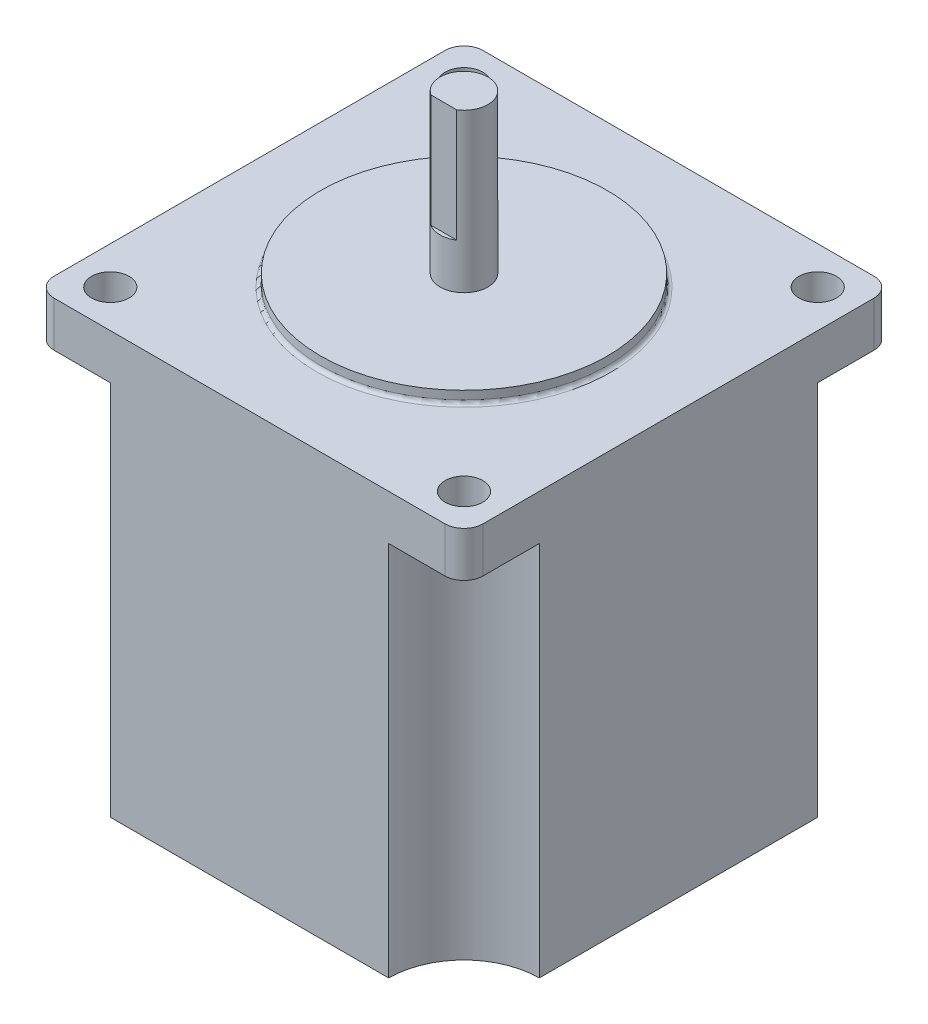
ISO-10303-21;
HEADER;
FILE_DESCRIPTION(('STEP AP214'),'2;1');
FILE_NAME('part.step','',(''),(''),'','','');
FILE_SCHEMA(('AUTOMOTIVE_DESIGN { 1 0 10303 214 1 1 1 1 }'));
ENDSEC;
DATA;
#1=APPLICATION_CONTEXT('core data for automotive mechanical design processes');
#2=APPLICATION_PROTOCOL_DEFINITION('international standard','automotive_design',2000,#1);
#3=PRODUCT_CONTEXT('',#1,'mechanical');
#4=PRODUCT('Part','Part','',(#3));
#5=PRODUCT_RELATED_PRODUCT_CATEGORY('part','',(#4));
#6=PRODUCT_DEFINITION_FORMATION('','',#4);
#7=PRODUCT_DEFINITION_CONTEXT('part definition',#1,'design');
#8=PRODUCT_DEFINITION('design','',#6,#7);
#9=PRODUCT_DEFINITION_SHAPE('','',#8);
#10=(LENGTH_UNIT() NAMED_UNIT(*) SI_UNIT(.MILLI.,.METRE.));
#11=(NAMED_UNIT(*) PLANE_ANGLE_UNIT() SI_UNIT($,.RADIAN.));
#12=(NAMED_UNIT(*) SI_UNIT($,.STERADIAN.) SOLID_ANGLE_UNIT());
#13=UNCERTAINTY_MEASURE_WITH_UNIT(LENGTH_MEASURE(1.E-05),#10,'distance_accuracy_value','');
#14=(GEOMETRIC_REPRESENTATION_CONTEXT(3) GLOBAL_UNCERTAINTY_ASSIGNED_CONTEXT((#13)) GLOBAL_UNIT_ASSIGNED_CONTEXT((#10,
#11,#12)) REPRESENTATION_CONTEXT('',''));
#15=CARTESIAN_POINT('',(0.,0.,0.));
#16=DIRECTION('',(0.,0.,1.));
#17=DIRECTION('',(1.,0.,0.));
#18=AXIS2_PLACEMENT_3D('',#15,#16,#17);
#19=CARTESIAN_POINT('',(-28.5,56.,28.5));
#20=DIRECTION('',(1.,0.,0.));
#21=DIRECTION('',(0.,0.,-1.));
#22=AXIS2_PLACEMENT_3D('',#19,#20,#21);
#23=PLANE('',#22);
#24=DIRECTION('',(0.,0.,1.));
#25=VECTOR('',#24,1.);
#26=CARTESIAN_POINT('',(-28.5,56.,28.5));
#27=LINE('',#26,#25);
#28=CARTESIAN_POINT('',(-28.5,56.,-25.96));
#29=VERTEX_POINT('',#28);
#30=CARTESIAN_POINT('',(-28.5,56.,25.96));
#31=VERTEX_POINT('',#30);
#32=EDGE_CURVE('E260',#29,#31,#27,.T.);
#33=ORIENTED_EDGE('',*,*,#32,.F.);
#34=DIRECTION('',(0.,-1.,0.));
#35=VECTOR('',#34,1.);
#36=CARTESIAN_POINT('',(-28.5,56.,-25.96));
#37=LINE('',#36,#35);
#38=CARTESIAN_POINT('',(-28.500000000007,50.,-25.96));
#39=VERTEX_POINT('',#38);
#40=EDGE_CURVE('E285',#29,#39,#37,.T.);
#41=ORIENTED_EDGE('',*,*,#40,.T.);
#42=DIRECTION('',(0.,0.,-1.));
#43=VECTOR('',#42,1.);
#44=CARTESIAN_POINT('',(-28.500000000007,50.,-28.5000000000005));
#45=LINE('',#44,#43);
#46=CARTESIAN_POINT('',(-28.500000000007,50.,-18.5000000000005));
#47=VERTEX_POINT('',#46);
#48=EDGE_CURVE('E204',#47,#39,#45,.T.);
#49=ORIENTED_EDGE('',*,*,#48,.F.);
#50=DIRECTION('',(0.,-1.,0.));
#51=VECTOR('',#50,1.);
#52=CARTESIAN_POINT('',(-28.500000000007,50.,-18.5000000000005));
#53=LINE('',#52,#51);
#54=CARTESIAN_POINT('',(-28.500000000007,0.,-18.5000000000005));
#55=VERTEX_POINT('',#54);
#56=EDGE_CURVE('E210',#47,#55,#53,.T.);
#57=ORIENTED_EDGE('',*,*,#56,.T.);
#58=DIRECTION('',(0.,0.,1.));
#59=VECTOR('',#58,1.);
#60=CARTESIAN_POINT('',(-28.5,0.,28.5));
#61=LINE('',#60,#59);
#62=CARTESIAN_POINT('',(-28.5,0.,18.5000000000065));
#63=VERTEX_POINT('',#62);
#64=EDGE_CURVE('E258',#55,#63,#61,.T.);
#65=ORIENTED_EDGE('',*,*,#64,.T.);
#66=DIRECTION('',(0.,-1.,0.));
#67=VECTOR('',#66,1.);
#68=CARTESIAN_POINT('',(-28.5000000000075,50.,18.5000000000065));
#69=LINE('',#68,#67);
#70=CARTESIAN_POINT('',(-28.5000000000075,50.,18.5000000000065));
#71=VERTEX_POINT('',#70);
#72=EDGE_CURVE('E224',#71,#63,#69,.T.);
#73=ORIENTED_EDGE('',*,*,#72,.F.);
#74=DIRECTION('',(0.,0.,-1.));
#75=VECTOR('',#74,1.);
#76=CARTESIAN_POINT('',(-28.5000000000075,50.,18.5000000000065));
#77=LINE('',#76,#75);
#78=CARTESIAN_POINT('',(-28.5000000000075,50.,25.96));
#79=VERTEX_POINT('',#78);
#80=EDGE_CURVE('E215',#79,#71,#77,.T.);
#81=ORIENTED_EDGE('',*,*,#80,.F.);
#82=DIRECTION('',(0.,-1.,0.));
#83=VECTOR('',#82,1.);
#84=CARTESIAN_POINT('',(-28.5,56.,25.96));
#85=LINE('',#84,#83);
#86=EDGE_CURVE('E273',#79,#31,#85,.F.);
#87=ORIENTED_EDGE('',*,*,#86,.T.);
#88=EDGE_LOOP('',(#33,#41,#49,#57,#65,#73,#81,#87));
#89=FACE_BOUND('',#88,.T.);
#90=ADVANCED_FACE('F34',(#89),#23,.F.);
#91=CARTESIAN_POINT('',(28.5,56.,28.5));
#92=DIRECTION('',(0.,0.,-1.));
#93=DIRECTION('',(-1.,0.,0.));
#94=AXIS2_PLACEMENT_3D('',#91,#92,#93);
#95=PLANE('',#94);
#96=DIRECTION('',(-1.,0.,0.));
#97=VECTOR('',#96,1.);
#98=CARTESIAN_POINT('',(18.4999999999995,50.,28.500000000007));
#99=LINE('',#98,#97);
#100=CARTESIAN_POINT('',(25.96,50.,28.500000000007));
#101=VERTEX_POINT('',#100);
#102=CARTESIAN_POINT('',(18.4999999999995,50.,28.500000000007));
#103=VERTEX_POINT('',#102);
#104=EDGE_CURVE('E230',#101,#103,#99,.T.);
#105=ORIENTED_EDGE('',*,*,#104,.F.);
#106=DIRECTION('',(0.,-1.,0.));
#107=VECTOR('',#106,1.);
#108=CARTESIAN_POINT('',(25.96,56.,28.5));
#109=LINE('',#108,#107);
#110=CARTESIAN_POINT('',(25.96,56.,28.5));
#111=VERTEX_POINT('',#110);
#112=EDGE_CURVE('E314',#101,#111,#109,.F.);
#113=ORIENTED_EDGE('',*,*,#112,.T.);
#114=DIRECTION('',(1.,0.,0.));
#115=VECTOR('',#114,1.);
#116=CARTESIAN_POINT('',(28.5,56.,28.5));
#117=LINE('',#116,#115);
#118=CARTESIAN_POINT('',(-25.96,56.,28.5));
#119=VERTEX_POINT('',#118);
#120=EDGE_CURVE('E263',#119,#111,#117,.T.);
#121=ORIENTED_EDGE('',*,*,#120,.F.);
#122=DIRECTION('',(0.,-1.,0.));
#123=VECTOR('',#122,1.);
#124=CARTESIAN_POINT('',(-25.96,56.,28.5));
#125=LINE('',#124,#123);
#126=CARTESIAN_POINT('',(-25.96,50.,28.5000000000065));
#127=VERTEX_POINT('',#126);
#128=EDGE_CURVE('E312',#119,#127,#125,.T.);
#129=ORIENTED_EDGE('',*,*,#128,.T.);
#130=DIRECTION('',(-1.,0.,0.));
#131=VECTOR('',#130,1.);
#132=CARTESIAN_POINT('',(-28.5000000000075,50.,28.5000000000065));
#133=LINE('',#132,#131);
#134=CARTESIAN_POINT('',(-18.5000000000075,50.,28.5000000000065));
#135=VERTEX_POINT('',#134);
#136=EDGE_CURVE('E221',#135,#127,#133,.T.);
#137=ORIENTED_EDGE('',*,*,#136,.F.);
#138=DIRECTION('',(0.,-1.,0.));
#139=VECTOR('',#138,1.);
#140=CARTESIAN_POINT('',(-18.5000000000075,50.,28.5000000000065));
#141=LINE('',#140,#139);
#142=CARTESIAN_POINT('',(-18.5000000000075,0.,28.5000000000065));
#143=VERTEX_POINT('',#142);
#144=EDGE_CURVE('E209',#135,#143,#141,.T.);
#145=ORIENTED_EDGE('',*,*,#144,.T.);
#146=DIRECTION('',(1.,0.,0.));
#147=VECTOR('',#146,1.);
#148=CARTESIAN_POINT('',(28.5,0.,28.5));
#149=LINE('',#148,#147);
#150=CARTESIAN_POINT('',(18.4999999999995,0.,28.5));
#151=VERTEX_POINT('',#150);
#152=EDGE_CURVE('E276',#143,#151,#149,.T.);
#153=ORIENTED_EDGE('',*,*,#152,.T.);
#154=DIRECTION('',(0.,-1.,0.));
#155=VECTOR('',#154,1.);
#156=CARTESIAN_POINT('',(18.4999999999995,50.,28.500000000007));
#157=LINE('',#156,#155);
#158=EDGE_CURVE('E239',#103,#151,#157,.T.);
#159=ORIENTED_EDGE('',*,*,#158,.F.);
#160=EDGE_LOOP('',(#105,#113,#121,#129,#137,#145,#153,#159));
#161=FACE_BOUND('',#160,.T.);
#162=ADVANCED_FACE('F349',(#161),#95,.F.);
#163=CARTESIAN_POINT('',(28.5,56.,28.5));
#164=DIRECTION('',(-1.,0.,0.));
#165=DIRECTION('',(0.,0.,1.));
#166=AXIS2_PLACEMENT_3D('',#163,#164,#165);
#167=PLANE('',#166);
#168=DIRECTION('',(0.,0.,1.));
#169=VECTOR('',#168,1.);
#170=CARTESIAN_POINT('',(28.5,50.,-18.5));
#171=LINE('',#170,#169);
#172=CARTESIAN_POINT('',(28.5,50.,-25.96));
#173=VERTEX_POINT('',#172);
#174=CARTESIAN_POINT('',(28.5,50.,-18.5));
#175=VERTEX_POINT('',#174);
#176=EDGE_CURVE('E248',#173,#175,#171,.T.);
#177=ORIENTED_EDGE('',*,*,#176,.F.);
#178=DIRECTION('',(0.,-1.,0.));
#179=VECTOR('',#178,1.);
#180=CARTESIAN_POINT('',(28.5,56.,-25.96));
#181=LINE('',#180,#179);
#182=CARTESIAN_POINT('',(28.5,56.,-25.96));
#183=VERTEX_POINT('',#182);
#184=EDGE_CURVE('E308',#173,#183,#181,.F.);
#185=ORIENTED_EDGE('',*,*,#184,.T.);
#186=DIRECTION('',(0.,0.,-1.));
#187=VECTOR('',#186,1.);
#188=CARTESIAN_POINT('',(28.5,56.,28.5));
#189=LINE('',#188,#187);
#190=CARTESIAN_POINT('',(28.5,56.,25.96));
#191=VERTEX_POINT('',#190);
#192=EDGE_CURVE('E267',#191,#183,#189,.T.);
#193=ORIENTED_EDGE('',*,*,#192,.F.);
#194=DIRECTION('',(0.,-1.,0.));
#195=VECTOR('',#194,1.);
#196=CARTESIAN_POINT('',(28.5,56.,25.96));
#197=LINE('',#196,#195);
#198=CARTESIAN_POINT('',(28.4999999999995,50.,25.96));
#199=VERTEX_POINT('',#198);
#200=EDGE_CURVE('E305',#191,#199,#197,.T.);
#201=ORIENTED_EDGE('',*,*,#200,.T.);
#202=DIRECTION('',(0.,0.,1.));
#203=VECTOR('',#202,1.);
#204=CARTESIAN_POINT('',(28.4999999999995,50.,28.500000000007));
#205=LINE('',#204,#203);
#206=CARTESIAN_POINT('',(28.4999999999995,50.,18.500000000007));
#207=VERTEX_POINT('',#206);
#208=EDGE_CURVE('E236',#207,#199,#205,.T.);
#209=ORIENTED_EDGE('',*,*,#208,.F.);
#210=DIRECTION('',(0.,-1.,0.));
#211=VECTOR('',#210,1.);
#212=CARTESIAN_POINT('',(28.4999999999995,50.,18.500000000007));
#213=LINE('',#212,#211);
#214=CARTESIAN_POINT('',(28.4999999999995,0.,18.500000000007));
#215=VERTEX_POINT('',#214);
#216=EDGE_CURVE('E226',#207,#215,#213,.T.);
#217=ORIENTED_EDGE('',*,*,#216,.T.);
#218=DIRECTION('',(0.,0.,-1.));
#219=VECTOR('',#218,1.);
#220=CARTESIAN_POINT('',(28.5,0.,28.5));
#221=LINE('',#220,#219);
#222=CARTESIAN_POINT('',(28.5,0.,-18.5));
#223=VERTEX_POINT('',#222);
#224=EDGE_CURVE('E279',#215,#223,#221,.T.);
#225=ORIENTED_EDGE('',*,*,#224,.T.);
#226=DIRECTION('',(0.,-1.,0.));
#227=VECTOR('',#226,1.);
#228=CARTESIAN_POINT('',(28.5,50.,-18.5));
#229=LINE('',#228,#227);
#230=EDGE_CURVE('E253',#175,#223,#229,.T.);
#231=ORIENTED_EDGE('',*,*,#230,.F.);
#232=EDGE_LOOP('',(#177,#185,#193,#201,#209,#217,#225,#231));
#233=FACE_BOUND('',#232,.T.);
#234=ADVANCED_FACE('F355',(#233),#167,.F.);
#235=CARTESIAN_POINT('',(28.5,56.,-28.5));
#236=DIRECTION('',(0.,0.,1.));
#237=DIRECTION('',(1.,0.,0.));
#238=AXIS2_PLACEMENT_3D('',#235,#236,#237);
#239=PLANE('',#238);
#240=DIRECTION('',(1.,0.,0.));
#241=VECTOR('',#240,1.);
#242=CARTESIAN_POINT('',(-18.500000000007,50.,-28.5000000000005));
#243=LINE('',#242,#241);
#244=CARTESIAN_POINT('',(-25.96,50.,-28.5000000000005));
#245=VERTEX_POINT('',#244);
#246=CARTESIAN_POINT('',(-18.500000000007,50.,-28.5000000000005));
#247=VERTEX_POINT('',#246);
#248=EDGE_CURVE('E198',#245,#247,#243,.T.);
#249=ORIENTED_EDGE('',*,*,#248,.F.);
#250=DIRECTION('',(0.,-1.,0.));
#251=VECTOR('',#250,1.);
#252=CARTESIAN_POINT('',(-25.96,56.,-28.5));
#253=LINE('',#252,#251);
#254=CARTESIAN_POINT('',(-25.96,56.,-28.5));
#255=VERTEX_POINT('',#254);
#256=EDGE_CURVE('E293',#245,#255,#253,.F.);
#257=ORIENTED_EDGE('',*,*,#256,.T.);
#258=DIRECTION('',(-1.,0.,0.));
#259=VECTOR('',#258,1.);
#260=CARTESIAN_POINT('',(28.5,56.,-28.5));
#261=LINE('',#260,#259);
#262=CARTESIAN_POINT('',(25.96,56.,-28.5));
#263=VERTEX_POINT('',#262);
#264=EDGE_CURVE('E270',#263,#255,#261,.T.);
#265=ORIENTED_EDGE('',*,*,#264,.F.);
#266=DIRECTION('',(0.,-1.,0.));
#267=VECTOR('',#266,1.);
#268=CARTESIAN_POINT('',(25.96,56.,-28.5));
#269=LINE('',#268,#267);
#270=CARTESIAN_POINT('',(25.96,50.,-28.5));
#271=VERTEX_POINT('',#270);
#272=EDGE_CURVE('E290',#263,#271,#269,.T.);
#273=ORIENTED_EDGE('',*,*,#272,.T.);
#274=DIRECTION('',(1.,0.,0.));
#275=VECTOR('',#274,1.);
#276=CARTESIAN_POINT('',(28.5,50.,-28.5));
#277=LINE('',#276,#275);
#278=CARTESIAN_POINT('',(18.5,50.,-28.5));
#279=VERTEX_POINT('',#278);
#280=EDGE_CURVE('E245',#279,#271,#277,.T.);
#281=ORIENTED_EDGE('',*,*,#280,.F.);
#282=DIRECTION('',(0.,-1.,0.));
#283=VECTOR('',#282,1.);
#284=CARTESIAN_POINT('',(18.5,50.,-28.5));
#285=LINE('',#284,#283);
#286=CARTESIAN_POINT('',(18.5,0.,-28.5));
#287=VERTEX_POINT('',#286);
#288=EDGE_CURVE('E255',#279,#287,#285,.T.);
#289=ORIENTED_EDGE('',*,*,#288,.T.);
#290=DIRECTION('',(-1.,0.,0.));
#291=VECTOR('',#290,1.);
#292=CARTESIAN_POINT('',(28.5,0.,-28.5));
#293=LINE('',#292,#291);
#294=CARTESIAN_POINT('',(-18.500000000007,0.,-28.5));
#295=VERTEX_POINT('',#294);
#296=EDGE_CURVE('E264',#287,#295,#293,.T.);
#297=ORIENTED_EDGE('',*,*,#296,.T.);
#298=DIRECTION('',(0.,-1.,0.));
#299=VECTOR('',#298,1.);
#300=CARTESIAN_POINT('',(-18.500000000007,50.,-28.5000000000005));
#301=LINE('',#300,#299);
#302=EDGE_CURVE('E207',#247,#295,#301,.T.);
#303=ORIENTED_EDGE('',*,*,#302,.F.);
#304=EDGE_LOOP('',(#249,#257,#265,#273,#281,#289,#297,#303));
#305=FACE_BOUND('',#304,.T.);
#306=ADVANCED_FACE('F403',(#305),#239,.F.);
#307=CARTESIAN_POINT('',(0.,56.,0.));
#308=DIRECTION('',(0.,1.,0.));
#309=DIRECTION('',(0.,0.,1.));
#310=AXIS2_PLACEMENT_3D('',#307,#308,#309);
#311=PLANE('',#310);
#312=CARTESIAN_POINT('',(0.,56.,0.));
#313=DIRECTION('',(0.,1.,0.));
#314=DIRECTION('',(0.,0.,1.));
#315=AXIS2_PLACEMENT_3D('',#312,#313,#314);
#316=CIRCLE('',#315,19.55);
#317=CARTESIAN_POINT('',(0.,56.,19.55));
#318=VERTEX_POINT('',#317);
#319=EDGE_CURVE('E38',#318,#318,#316,.F.);
#320=ORIENTED_EDGE('',*,*,#319,.T.);
#321=EDGE_LOOP('',(#320));
#322=FACE_BOUND('',#321,.T.);
#323=CARTESIAN_POINT('',(23.50001,56.,23.50001));
#324=DIRECTION('',(0.,1.,0.));
#325=DIRECTION('',(0.,0.,1.));
#326=AXIS2_PLACEMENT_3D('',#323,#324,#325);
#327=CIRCLE('',#326,2.499995);
#328=CARTESIAN_POINT('',(23.50001,56.,26.000005));
#329=VERTEX_POINT('',#328);
#330=EDGE_CURVE('E185',#329,#329,#327,.T.);
#331=ORIENTED_EDGE('',*,*,#330,.F.);
#332=EDGE_LOOP('',(#331));
#333=FACE_BOUND('',#332,.T.);
#334=CARTESIAN_POINT('',(23.50001,56.,-23.50001));
#335=DIRECTION('',(0.,1.,0.));
#336=DIRECTION('',(0.,0.,1.));
#337=AXIS2_PLACEMENT_3D('',#334,#335,#336);
#338=CIRCLE('',#337,2.499995);
#339=CARTESIAN_POINT('',(23.50001,56.,-21.000015));
#340=VERTEX_POINT('',#339);
#341=EDGE_CURVE('E190',#340,#340,#338,.T.);
#342=ORIENTED_EDGE('',*,*,#341,.F.);
#343=EDGE_LOOP('',(#342));
#344=FACE_BOUND('',#343,.T.);
#345=CARTESIAN_POINT('',(-23.50001,56.,-23.50001));
#346=DIRECTION('',(0.,1.,0.));
#347=DIRECTION('',(0.,0.,1.));
#348=AXIS2_PLACEMENT_3D('',#345,#346,#347);
#349=CIRCLE('',#348,2.499995);
#350=CARTESIAN_POINT('',(-23.50001,56.,-21.000015));
#351=VERTEX_POINT('',#350);
#352=EDGE_CURVE('E186',#351,#351,#349,.T.);
#353=ORIENTED_EDGE('',*,*,#352,.F.);
#354=EDGE_LOOP('',(#353));
#355=FACE_BOUND('',#354,.T.);
#356=CARTESIAN_POINT('',(-23.50001,56.,23.50001));
#357=DIRECTION('',(0.,1.,0.));
#358=DIRECTION('',(0.,0.,1.));
#359=AXIS2_PLACEMENT_3D('',#356,#357,#358);
#360=CIRCLE('',#359,2.499995);
#361=CARTESIAN_POINT('',(-23.50001,56.,26.000005));
#362=VERTEX_POINT('',#361);
#363=EDGE_CURVE('E189',#362,#362,#360,.T.);
#364=ORIENTED_EDGE('',*,*,#363,.F.);
#365=EDGE_LOOP('',(#364));
#366=FACE_BOUND('',#365,.T.);
#367=ORIENTED_EDGE('',*,*,#264,.T.);
#368=CARTESIAN_POINT('',(-25.96,56.,-25.96));
#369=DIRECTION('',(0.,1.,0.));
#370=DIRECTION('',(0.,0.,1.));
#371=AXIS2_PLACEMENT_3D('',#368,#369,#370);
#372=CIRCLE('',#371,2.54);
#373=EDGE_CURVE('E301',#255,#29,#372,.T.);
#374=ORIENTED_EDGE('',*,*,#373,.T.);
#375=ORIENTED_EDGE('',*,*,#32,.T.);
#376=CARTESIAN_POINT('',(-25.96,56.,25.96));
#377=DIRECTION('',(0.,1.,0.));
#378=DIRECTION('',(0.,0.,1.));
#379=AXIS2_PLACEMENT_3D('',#376,#377,#378);
#380=CIRCLE('',#379,2.54);
#381=EDGE_CURVE('E295',#31,#119,#380,.T.);
#382=ORIENTED_EDGE('',*,*,#381,.T.);
#383=ORIENTED_EDGE('',*,*,#120,.T.);
#384=CARTESIAN_POINT('',(25.96,56.,25.96));
#385=DIRECTION('',(0.,1.,0.));
#386=DIRECTION('',(0.,0.,1.));
#387=AXIS2_PLACEMENT_3D('',#384,#385,#386);
#388=CIRCLE('',#387,2.54);
#389=EDGE_CURVE('E297',#111,#191,#388,.T.);
#390=ORIENTED_EDGE('',*,*,#389,.T.);
#391=ORIENTED_EDGE('',*,*,#192,.T.);
#392=CARTESIAN_POINT('',(25.96,56.,-25.96));
#393=DIRECTION('',(0.,1.,0.));
#394=DIRECTION('',(0.,0.,1.));
#395=AXIS2_PLACEMENT_3D('',#392,#393,#394);
#396=CIRCLE('',#395,2.54);
#397=EDGE_CURVE('E299',#183,#263,#396,.T.);
#398=ORIENTED_EDGE('',*,*,#397,.T.);
#399=EDGE_LOOP('',(#367,#374,#375,#382,#383,#390,#391,#398));
#400=FACE_BOUND('',#399,.T.);
#401=ADVANCED_FACE('F333',(#322,#333,#344,#355,#366,#400),#311,.T.);
#402=CARTESIAN_POINT('',(0.,0.,0.));
#403=DIRECTION('',(0.,1.,0.));
#404=DIRECTION('',(0.,0.,1.));
#405=AXIS2_PLACEMENT_3D('',#402,#403,#404);
#406=PLANE('',#405);
#407=ORIENTED_EDGE('',*,*,#224,.F.);
#408=CARTESIAN_POINT('',(28.4999999999995,0.,28.500000000007));
#409=DIRECTION('',(0.,-1.,0.));
#410=DIRECTION('',(0.,0.,1.));
#411=AXIS2_PLACEMENT_3D('',#408,#409,#410);
#412=CIRCLE('',#411,10.);
#413=EDGE_CURVE('E233',#151,#215,#412,.T.);
#414=ORIENTED_EDGE('',*,*,#413,.F.);
#415=ORIENTED_EDGE('',*,*,#152,.F.);
#416=CARTESIAN_POINT('',(-28.5000000000075,0.,28.5000000000065));
#417=DIRECTION('',(0.,-1.,0.));
#418=DIRECTION('',(0.,0.,1.));
#419=AXIS2_PLACEMENT_3D('',#416,#417,#418);
#420=CIRCLE('',#419,9.99999999999999);
#421=EDGE_CURVE('E218',#63,#143,#420,.T.);
#422=ORIENTED_EDGE('',*,*,#421,.F.);
#423=ORIENTED_EDGE('',*,*,#64,.F.);
#424=CARTESIAN_POINT('',(-28.500000000007,0.,-28.5000000000005));
#425=DIRECTION('',(0.,-1.,0.));
#426=DIRECTION('',(0.,0.,1.));
#427=AXIS2_PLACEMENT_3D('',#424,#425,#426);
#428=CIRCLE('',#427,10.);
#429=EDGE_CURVE('E201',#295,#55,#428,.T.);
#430=ORIENTED_EDGE('',*,*,#429,.F.);
#431=ORIENTED_EDGE('',*,*,#296,.F.);
#432=CARTESIAN_POINT('',(28.5,0.,-28.5));
#433=DIRECTION('',(0.,-1.,0.));
#434=DIRECTION('',(0.,0.,1.));
#435=AXIS2_PLACEMENT_3D('',#432,#433,#434);
#436=CIRCLE('',#435,10.);
#437=EDGE_CURVE('E213',#223,#287,#436,.T.);
#438=ORIENTED_EDGE('',*,*,#437,.F.);
#439=EDGE_LOOP('',(#407,#414,#415,#422,#423,#430,#431,#438));
#440=FACE_BOUND('',#439,.T.);
#441=ADVANCED_FACE('F421',(#440),#406,.F.);
#442=CARTESIAN_POINT('',(28.5,50.,-28.5));
#443=DIRECTION('',(0.,-1.,0.));
#444=DIRECTION('',(0.,0.,-1.));
#445=AXIS2_PLACEMENT_3D('',#442,#443,#444);
#446=CYLINDRICAL_SURFACE('',#445,10.);
#447=ORIENTED_EDGE('',*,*,#437,.T.);
#448=ORIENTED_EDGE('',*,*,#288,.F.);
#449=CARTESIAN_POINT('',(28.5,50.,-28.5));
#450=DIRECTION('',(0.,-1.,0.));
#451=DIRECTION('',(0.,0.,1.));
#452=AXIS2_PLACEMENT_3D('',#449,#450,#451);
#453=CIRCLE('',#452,10.);
#454=EDGE_CURVE('E250',#175,#279,#453,.T.);
#455=ORIENTED_EDGE('',*,*,#454,.F.);
#456=ORIENTED_EDGE('',*,*,#230,.T.);
#457=EDGE_LOOP('',(#447,#448,#455,#456));
#458=FACE_BOUND('',#457,.T.);
#459=ADVANCED_FACE('F442',(#458),#446,.F.);
#460=CARTESIAN_POINT('',(28.5,50.,-28.5));
#461=DIRECTION('',(0.,1.,0.));
#462=DIRECTION('',(0.,0.,1.));
#463=AXIS2_PLACEMENT_3D('',#460,#461,#462);
#464=PLANE('',#463);
#465=CARTESIAN_POINT('',(23.50001,50.,-23.50001));
#466=DIRECTION('',(0.,1.,0.));
#467=DIRECTION('',(0.,0.,1.));
#468=AXIS2_PLACEMENT_3D('',#465,#466,#467);
#469=CIRCLE('',#468,2.499995);
#470=CARTESIAN_POINT('',(23.50001,50.,-21.000015));
#471=VERTEX_POINT('',#470);
#472=EDGE_CURVE('E241',#471,#471,#469,.T.);
#473=ORIENTED_EDGE('',*,*,#472,.T.);
#474=EDGE_LOOP('',(#473));
#475=FACE_BOUND('',#474,.T.);
#476=ORIENTED_EDGE('',*,*,#280,.T.);
#477=CARTESIAN_POINT('',(25.96,50.,-25.96));
#478=DIRECTION('',(0.,1.,0.));
#479=DIRECTION('',(0.,0.,1.));
#480=AXIS2_PLACEMENT_3D('',#477,#478,#479);
#481=CIRCLE('',#480,2.54);
#482=EDGE_CURVE('E303',#271,#173,#481,.F.);
#483=ORIENTED_EDGE('',*,*,#482,.T.);
#484=ORIENTED_EDGE('',*,*,#176,.T.);
#485=ORIENTED_EDGE('',*,*,#454,.T.);
#486=EDGE_LOOP('',(#476,#483,#484,#485));
#487=FACE_BOUND('',#486,.T.);
#488=ADVANCED_FACE('F438',(#475,#487),#464,.F.);
#489=CARTESIAN_POINT('',(-28.500000000007,50.,-28.5000000000005));
#490=DIRECTION('',(0.,-1.,0.));
#491=DIRECTION('',(0.,0.,-1.));
#492=AXIS2_PLACEMENT_3D('',#489,#490,#491);
#493=CYLINDRICAL_SURFACE('',#492,10.);
#494=ORIENTED_EDGE('',*,*,#429,.T.);
#495=ORIENTED_EDGE('',*,*,#56,.F.);
#496=CARTESIAN_POINT('',(-28.500000000007,50.,-28.5000000000005));
#497=DIRECTION('',(0.,-1.,0.));
#498=DIRECTION('',(0.,0.,1.));
#499=AXIS2_PLACEMENT_3D('',#496,#497,#498);
#500=CIRCLE('',#499,10.);
#501=EDGE_CURVE('E200',#247,#47,#500,.T.);
#502=ORIENTED_EDGE('',*,*,#501,.F.);
#503=ORIENTED_EDGE('',*,*,#302,.T.);
#504=EDGE_LOOP('',(#494,#495,#502,#503));
#505=FACE_BOUND('',#504,.T.);
#506=ADVANCED_FACE('F441',(#505),#493,.F.);
#507=CARTESIAN_POINT('',(-28.500000000007,50.,-28.5000000000005));
#508=DIRECTION('',(0.,1.,0.));
#509=DIRECTION('',(0.,0.,1.));
#510=AXIS2_PLACEMENT_3D('',#507,#508,#509);
#511=PLANE('',#510);
#512=CARTESIAN_POINT('',(-23.50001,50.,-23.50001));
#513=DIRECTION('',(0.,1.,0.));
#514=DIRECTION('',(0.,0.,1.));
#515=AXIS2_PLACEMENT_3D('',#512,#513,#514);
#516=CIRCLE('',#515,2.499995);
#517=CARTESIAN_POINT('',(-23.50001,50.,-21.000015));
#518=VERTEX_POINT('',#517);
#519=EDGE_CURVE('E323',#518,#518,#516,.T.);
#520=ORIENTED_EDGE('',*,*,#519,.T.);
#521=EDGE_LOOP('',(#520));
#522=FACE_BOUND('',#521,.T.);
#523=ORIENTED_EDGE('',*,*,#48,.T.);
#524=CARTESIAN_POINT('',(-25.96,50.,-25.96));
#525=DIRECTION('',(0.,1.,0.));
#526=DIRECTION('',(0.,0.,1.));
#527=AXIS2_PLACEMENT_3D('',#524,#525,#526);
#528=CIRCLE('',#527,2.54);
#529=EDGE_CURVE('E288',#39,#245,#528,.F.);
#530=ORIENTED_EDGE('',*,*,#529,.T.);
#531=ORIENTED_EDGE('',*,*,#248,.T.);
#532=ORIENTED_EDGE('',*,*,#501,.T.);
#533=EDGE_LOOP('',(#523,#530,#531,#532));
#534=FACE_BOUND('',#533,.T.);
#535=ADVANCED_FACE('F487',(#522,#534),#511,.F.);
#536=CARTESIAN_POINT('',(-28.5000000000075,50.,28.5000000000065));
#537=DIRECTION('',(0.,-1.,0.));
#538=DIRECTION('',(0.,0.,-1.));
#539=AXIS2_PLACEMENT_3D('',#536,#537,#538);
#540=CYLINDRICAL_SURFACE('',#539,9.99999999999999);
#541=ORIENTED_EDGE('',*,*,#421,.T.);
#542=ORIENTED_EDGE('',*,*,#144,.F.);
#543=CARTESIAN_POINT('',(-28.5000000000075,50.,28.5000000000065));
#544=DIRECTION('',(0.,-1.,0.));
#545=DIRECTION('',(0.,0.,1.));
#546=AXIS2_PLACEMENT_3D('',#543,#544,#545);
#547=CIRCLE('',#546,9.99999999999999);
#548=EDGE_CURVE('E217',#71,#135,#547,.T.);
#549=ORIENTED_EDGE('',*,*,#548,.F.);
#550=ORIENTED_EDGE('',*,*,#72,.T.);
#551=EDGE_LOOP('',(#541,#542,#549,#550));
#552=FACE_BOUND('',#551,.T.);
#553=ADVANCED_FACE('F415',(#552),#540,.F.);
#554=CARTESIAN_POINT('',(-28.5000000000075,50.,28.5000000000065));
#555=DIRECTION('',(0.,1.,0.));
#556=DIRECTION('',(0.,0.,1.));
#557=AXIS2_PLACEMENT_3D('',#554,#555,#556);
#558=PLANE('',#557);
#559=CARTESIAN_POINT('',(-23.50001,50.,23.50001));
#560=DIRECTION('',(0.,1.,0.));
#561=DIRECTION('',(0.,0.,1.));
#562=AXIS2_PLACEMENT_3D('',#559,#560,#561);
#563=CIRCLE('',#562,2.499995);
#564=CARTESIAN_POINT('',(-23.50001,50.,26.000005));
#565=VERTEX_POINT('',#564);
#566=EDGE_CURVE('E320',#565,#565,#563,.T.);
#567=ORIENTED_EDGE('',*,*,#566,.T.);
#568=EDGE_LOOP('',(#567));
#569=FACE_BOUND('',#568,.T.);
#570=ORIENTED_EDGE('',*,*,#136,.T.);
#571=CARTESIAN_POINT('',(-25.96,50.,25.96));
#572=DIRECTION('',(0.,1.,0.));
#573=DIRECTION('',(0.,0.,1.));
#574=AXIS2_PLACEMENT_3D('',#571,#572,#573);
#575=CIRCLE('',#574,2.54);
#576=EDGE_CURVE('E58',#127,#79,#575,.F.);
#577=ORIENTED_EDGE('',*,*,#576,.T.);
#578=ORIENTED_EDGE('',*,*,#80,.T.);
#579=ORIENTED_EDGE('',*,*,#548,.T.);
#580=EDGE_LOOP('',(#570,#577,#578,#579));
#581=FACE_BOUND('',#580,.T.);
#582=ADVANCED_FACE('F413',(#569,#581),#558,.F.);
#583=CARTESIAN_POINT('',(28.4999999999995,50.,28.500000000007));
#584=DIRECTION('',(0.,-1.,0.));
#585=DIRECTION('',(0.,0.,-1.));
#586=AXIS2_PLACEMENT_3D('',#583,#584,#585);
#587=CYLINDRICAL_SURFACE('',#586,10.);
#588=ORIENTED_EDGE('',*,*,#413,.T.);
#589=ORIENTED_EDGE('',*,*,#216,.F.);
#590=CARTESIAN_POINT('',(28.4999999999995,50.,28.500000000007));
#591=DIRECTION('',(0.,-1.,0.));
#592=DIRECTION('',(0.,0.,1.));
#593=AXIS2_PLACEMENT_3D('',#590,#591,#592);
#594=CIRCLE('',#593,10.);
#595=EDGE_CURVE('E232',#103,#207,#594,.T.);
#596=ORIENTED_EDGE('',*,*,#595,.F.);
#597=ORIENTED_EDGE('',*,*,#158,.T.);
#598=EDGE_LOOP('',(#588,#589,#596,#597));
#599=FACE_BOUND('',#598,.T.);
#600=ADVANCED_FACE('F425',(#599),#587,.F.);
#601=CARTESIAN_POINT('',(28.4999999999995,50.,28.500000000007));
#602=DIRECTION('',(0.,1.,0.));
#603=DIRECTION('',(0.,0.,1.));
#604=AXIS2_PLACEMENT_3D('',#601,#602,#603);
#605=PLANE('',#604);
#606=CARTESIAN_POINT('',(23.50001,50.,23.50001));
#607=DIRECTION('',(0.,1.,0.));
#608=DIRECTION('',(0.,0.,1.));
#609=AXIS2_PLACEMENT_3D('',#606,#607,#608);
#610=CIRCLE('',#609,2.499995);
#611=CARTESIAN_POINT('',(23.50001,50.,26.000005));
#612=VERTEX_POINT('',#611);
#613=EDGE_CURVE('E197',#612,#612,#610,.T.);
#614=ORIENTED_EDGE('',*,*,#613,.T.);
#615=EDGE_LOOP('',(#614));
#616=FACE_BOUND('',#615,.T.);
#617=ORIENTED_EDGE('',*,*,#208,.T.);
#618=CARTESIAN_POINT('',(25.96,50.,25.96));
#619=DIRECTION('',(0.,1.,0.));
#620=DIRECTION('',(0.,0.,1.));
#621=AXIS2_PLACEMENT_3D('',#618,#619,#620);
#622=CIRCLE('',#621,2.54);
#623=EDGE_CURVE('E310',#199,#101,#622,.F.);
#624=ORIENTED_EDGE('',*,*,#623,.T.);
#625=ORIENTED_EDGE('',*,*,#104,.T.);
#626=ORIENTED_EDGE('',*,*,#595,.T.);
#627=EDGE_LOOP('',(#617,#624,#625,#626));
#628=FACE_BOUND('',#627,.T.);
#629=ADVANCED_FACE('F365',(#616,#628),#605,.F.);
#630=CARTESIAN_POINT('',(-25.96,56.,-25.96));
#631=DIRECTION('',(0.,-1.,0.));
#632=DIRECTION('',(0.,0.,-1.));
#633=AXIS2_PLACEMENT_3D('',#630,#631,#632);
#634=CYLINDRICAL_SURFACE('',#633,2.54);
#635=ORIENTED_EDGE('',*,*,#373,.F.);
#636=ORIENTED_EDGE('',*,*,#256,.F.);
#637=ORIENTED_EDGE('',*,*,#529,.F.);
#638=ORIENTED_EDGE('',*,*,#40,.F.);
#639=EDGE_LOOP('',(#635,#636,#637,#638));
#640=FACE_BOUND('',#639,.T.);
#641=ADVANCED_FACE('F361',(#640),#634,.T.);
#642=CARTESIAN_POINT('',(25.96,56.,-25.96));
#643=DIRECTION('',(0.,-1.,0.));
#644=DIRECTION('',(0.,0.,-1.));
#645=AXIS2_PLACEMENT_3D('',#642,#643,#644);
#646=CYLINDRICAL_SURFACE('',#645,2.54);
#647=ORIENTED_EDGE('',*,*,#397,.F.);
#648=ORIENTED_EDGE('',*,*,#184,.F.);
#649=ORIENTED_EDGE('',*,*,#482,.F.);
#650=ORIENTED_EDGE('',*,*,#272,.F.);
#651=EDGE_LOOP('',(#647,#648,#649,#650));
#652=FACE_BOUND('',#651,.T.);
#653=ADVANCED_FACE('F364',(#652),#646,.T.);
#654=CARTESIAN_POINT('',(25.96,56.,25.96));
#655=DIRECTION('',(0.,-1.,0.));
#656=DIRECTION('',(0.,0.,-1.));
#657=AXIS2_PLACEMENT_3D('',#654,#655,#656);
#658=CYLINDRICAL_SURFACE('',#657,2.54);
#659=ORIENTED_EDGE('',*,*,#389,.F.);
#660=ORIENTED_EDGE('',*,*,#112,.F.);
#661=ORIENTED_EDGE('',*,*,#623,.F.);
#662=ORIENTED_EDGE('',*,*,#200,.F.);
#663=EDGE_LOOP('',(#659,#660,#661,#662));
#664=FACE_BOUND('',#663,.T.);
#665=ADVANCED_FACE('F369',(#664),#658,.T.);
#666=CARTESIAN_POINT('',(-25.96,56.,25.96));
#667=DIRECTION('',(0.,-1.,0.));
#668=DIRECTION('',(0.,0.,-1.));
#669=AXIS2_PLACEMENT_3D('',#666,#667,#668);
#670=CYLINDRICAL_SURFACE('',#669,2.54);
#671=ORIENTED_EDGE('',*,*,#381,.F.);
#672=ORIENTED_EDGE('',*,*,#86,.F.);
#673=ORIENTED_EDGE('',*,*,#576,.F.);
#674=ORIENTED_EDGE('',*,*,#128,.F.);
#675=EDGE_LOOP('',(#671,#672,#673,#674));
#676=FACE_BOUND('',#675,.T.);
#677=ADVANCED_FACE('F372',(#676),#670,.T.);
#678=CARTESIAN_POINT('',(23.50001,30.6,23.50001));
#679=DIRECTION('',(0.,1.,0.));
#680=DIRECTION('',(0.,0.,1.));
#681=AXIS2_PLACEMENT_3D('',#678,#679,#680);
#682=CYLINDRICAL_SURFACE('',#681,2.499995);
#683=ORIENTED_EDGE('',*,*,#330,.T.);
#684=EDGE_LOOP('',(#683));
#685=FACE_BOUND('',#684,.T.);
#686=ORIENTED_EDGE('',*,*,#613,.F.);
#687=EDGE_LOOP('',(#686));
#688=FACE_BOUND('',#687,.T.);
#689=ADVANCED_FACE('F375',(#685,#688),#682,.F.);
#690=CARTESIAN_POINT('',(-23.50001,30.6,23.50001));
#691=DIRECTION('',(0.,1.,0.));
#692=DIRECTION('',(0.,0.,1.));
#693=AXIS2_PLACEMENT_3D('',#690,#691,#692);
#694=CYLINDRICAL_SURFACE('',#693,2.499995);
#695=ORIENTED_EDGE('',*,*,#363,.T.);
#696=EDGE_LOOP('',(#695));
#697=FACE_BOUND('',#696,.T.);
#698=ORIENTED_EDGE('',*,*,#566,.F.);
#699=EDGE_LOOP('',(#698));
#700=FACE_BOUND('',#699,.T.);
#701=ADVANCED_FACE('F379',(#697,#700),#694,.F.);
#702=CARTESIAN_POINT('',(-23.50001,30.6,-23.50001));
#703=DIRECTION('',(0.,1.,0.));
#704=DIRECTION('',(0.,0.,1.));
#705=AXIS2_PLACEMENT_3D('',#702,#703,#704);
#706=CYLINDRICAL_SURFACE('',#705,2.499995);
#707=ORIENTED_EDGE('',*,*,#352,.T.);
#708=EDGE_LOOP('',(#707));
#709=FACE_BOUND('',#708,.T.);
#710=ORIENTED_EDGE('',*,*,#519,.F.);
#711=EDGE_LOOP('',(#710));
#712=FACE_BOUND('',#711,.T.);
#713=ADVANCED_FACE('F575',(#709,#712),#706,.F.);
#714=CARTESIAN_POINT('',(23.50001,30.6,-23.50001));
#715=DIRECTION('',(0.,1.,0.));
#716=DIRECTION('',(0.,0.,1.));
#717=AXIS2_PLACEMENT_3D('',#714,#715,#716);
#718=CYLINDRICAL_SURFACE('',#717,2.499995);
#719=ORIENTED_EDGE('',*,*,#341,.T.);
#720=EDGE_LOOP('',(#719));
#721=FACE_BOUND('',#720,.T.);
#722=ORIENTED_EDGE('',*,*,#472,.F.);
#723=EDGE_LOOP('',(#722));
#724=FACE_BOUND('',#723,.T.);
#725=ADVANCED_FACE('F584',(#721,#724),#718,.F.);
#726=CARTESIAN_POINT('',(0.,57.6,0.));
#727=DIRECTION('',(0.,-1.,0.));
#728=DIRECTION('',(0.,0.,-1.));
#729=AXIS2_PLACEMENT_3D('',#726,#727,#728);
#730=CYLINDRICAL_SURFACE('',#729,19.05);
#731=CARTESIAN_POINT('',(0.,56.5,0.));
#732=DIRECTION('',(0.,1.,0.));
#733=DIRECTION('',(0.,0.,1.));
#734=AXIS2_PLACEMENT_3D('',#731,#732,#733);
#735=CIRCLE('',#734,19.05);
#736=CARTESIAN_POINT('',(0.,56.5,19.05));
#737=VERTEX_POINT('',#736);
#738=EDGE_CURVE('E317',#737,#737,#735,.T.);
#739=ORIENTED_EDGE('',*,*,#738,.T.);
#740=EDGE_LOOP('',(#739));
#741=FACE_BOUND('',#740,.T.);
#742=CARTESIAN_POINT('',(0.,57.6,0.));
#743=DIRECTION('',(0.,1.,0.));
#744=DIRECTION('',(0.,0.,1.));
#745=AXIS2_PLACEMENT_3D('',#742,#743,#744);
#746=CIRCLE('',#745,19.05);
#747=CARTESIAN_POINT('',(0.,57.6,19.05));
#748=VERTEX_POINT('',#747);
#749=EDGE_CURVE('E181',#748,#748,#746,.T.);
#750=ORIENTED_EDGE('',*,*,#749,.F.);
#751=EDGE_LOOP('',(#750));
#752=FACE_BOUND('',#751,.T.);
#753=ADVANCED_FACE('F345',(#741,#752),#730,.T.);
#754=CARTESIAN_POINT('',(0.,57.6,0.));
#755=DIRECTION('',(0.,1.,0.));
#756=DIRECTION('',(0.,0.,1.));
#757=AXIS2_PLACEMENT_3D('',#754,#755,#756);
#758=PLANE('',#757);
#759=CARTESIAN_POINT('',(0.,57.6,0.));
#760=DIRECTION('',(0.,1.,0.));
#761=DIRECTION('',(0.,0.,1.));
#762=AXIS2_PLACEMENT_3D('',#759,#760,#761);
#763=CIRCLE('',#762,3.175);
#764=CARTESIAN_POINT('',(0.,57.6,3.175));
#765=VERTEX_POINT('',#764);
#766=EDGE_CURVE('E11',#765,#765,#763,.T.);
#767=ORIENTED_EDGE('',*,*,#766,.F.);
#768=EDGE_LOOP('',(#767));
#769=FACE_BOUND('',#768,.T.);
#770=ORIENTED_EDGE('',*,*,#749,.T.);
#771=EDGE_LOOP('',(#770));
#772=FACE_BOUND('',#771,.T.);
#773=ADVANCED_FACE('F338',(#769,#772),#758,.T.);
#774=CARTESIAN_POINT('',(0.,56.5,0.));
#775=DIRECTION('',(0.,1.,0.));
#776=DIRECTION('',(0.,0.,1.));
#777=AXIS2_PLACEMENT_3D('',#774,#775,#776);
#778=TOROIDAL_SURFACE('',#777,19.55,0.5);
#779=ORIENTED_EDGE('',*,*,#319,.F.);
#780=EDGE_LOOP('',(#779));
#781=FACE_BOUND('',#780,.T.);
#782=ORIENTED_EDGE('',*,*,#738,.F.);
#783=EDGE_LOOP('',(#782));
#784=FACE_BOUND('',#783,.T.);
#785=ADVANCED_FACE('F36',(#781,#784),#778,.F.);
#786=CARTESIAN_POINT('',(0.,78.6,0.));
#787=DIRECTION('',(0.,-1.,0.));
#788=DIRECTION('',(0.,0.,-1.));
#789=AXIS2_PLACEMENT_3D('',#786,#787,#788);
#790=CYLINDRICAL_SURFACE('',#789,3.175);
#791=CARTESIAN_POINT('',(0.,78.6,0.));
#792=DIRECTION('',(0.,1.,0.));
#793=DIRECTION('',(0.,0.,1.));
#794=AXIS2_PLACEMENT_3D('',#791,#792,#793);
#795=CIRCLE('',#794,3.175);
#796=CARTESIAN_POINT('',(1.71026313764871,78.6,2.675));
#797=VERTEX_POINT('',#796);
#798=CARTESIAN_POINT('',(-1.71026313764871,78.6,2.675));
#799=VERTEX_POINT('',#798);
#800=EDGE_CURVE('E176',#797,#799,#795,.T.);
#801=ORIENTED_EDGE('',*,*,#800,.F.);
#802=DIRECTION('',(0.,1.,0.));
#803=VECTOR('',#802,1.);
#804=CARTESIAN_POINT('',(1.71026313764871,63.6,2.675));
#805=LINE('',#804,#803);
#806=CARTESIAN_POINT('',(1.71026313764871,63.6,2.675));
#807=VERTEX_POINT('',#806);
#808=EDGE_CURVE('E50',#807,#797,#805,.T.);
#809=ORIENTED_EDGE('',*,*,#808,.F.);
#810=CARTESIAN_POINT('',(0.,63.6,0.));
#811=DIRECTION('',(0.,1.,0.));
#812=DIRECTION('',(0.,0.,1.));
#813=AXIS2_PLACEMENT_3D('',#810,#811,#812);
#814=CIRCLE('',#813,3.175);
#815=CARTESIAN_POINT('',(-1.71026313764871,63.6,2.675));
#816=VERTEX_POINT('',#815);
#817=EDGE_CURVE('E162',#816,#807,#814,.T.);
#818=ORIENTED_EDGE('',*,*,#817,.F.);
#819=DIRECTION('',(0.,1.,0.));
#820=VECTOR('',#819,1.);
#821=CARTESIAN_POINT('',(-1.71026313764871,63.6,2.675));
#822=LINE('',#821,#820);
#823=EDGE_CURVE('E170',#816,#799,#822,.T.);
#824=ORIENTED_EDGE('',*,*,#823,.T.);
#825=EDGE_LOOP('',(#801,#809,#818,#824));
#826=FACE_BOUND('',#825,.T.);
#827=ORIENTED_EDGE('',*,*,#766,.T.);
#828=EDGE_LOOP('',(#827));
#829=FACE_BOUND('',#828,.T.);
#830=ADVANCED_FACE('F173',(#826,#829),#790,.T.);
#831=CARTESIAN_POINT('',(0.,78.6,0.));
#832=DIRECTION('',(0.,1.,0.));
#833=DIRECTION('',(0.,0.,1.));
#834=AXIS2_PLACEMENT_3D('',#831,#832,#833);
#835=PLANE('',#834);
#836=DIRECTION('',(-1.,0.,0.));
#837=VECTOR('',#836,1.);
#838=CARTESIAN_POINT('',(1.71026313764871,78.6,2.675));
#839=LINE('',#838,#837);
#840=EDGE_CURVE('E167',#797,#799,#839,.T.);
#841=ORIENTED_EDGE('',*,*,#840,.F.);
#842=ORIENTED_EDGE('',*,*,#800,.T.);
#843=EDGE_LOOP('',(#841,#842));
#844=FACE_BOUND('',#843,.T.);
#845=ADVANCED_FACE('F343',(#844),#835,.T.);
#846=CARTESIAN_POINT('',(1.71026313764871,63.6,2.675));
#847=DIRECTION('',(0.,0.,-1.));
#848=DIRECTION('',(-1.,0.,0.));
#849=AXIS2_PLACEMENT_3D('',#846,#847,#848);
#850=PLANE('',#849);
#851=ORIENTED_EDGE('',*,*,#840,.T.);
#852=ORIENTED_EDGE('',*,*,#823,.F.);
#853=DIRECTION('',(-1.,0.,0.));
#854=VECTOR('',#853,1.);
#855=CARTESIAN_POINT('',(1.71026313764871,63.6,2.675));
#856=LINE('',#855,#854);
#857=EDGE_CURVE('E164',#807,#816,#856,.T.);
#858=ORIENTED_EDGE('',*,*,#857,.F.);
#859=ORIENTED_EDGE('',*,*,#808,.T.);
#860=EDGE_LOOP('',(#851,#852,#858,#859));
#861=FACE_BOUND('',#860,.T.);
#862=ADVANCED_FACE('F169',(#861),#850,.F.);
#863=CARTESIAN_POINT('',(0.,63.6,0.));
#864=DIRECTION('',(0.,1.,0.));
#865=DIRECTION('',(0.,0.,1.));
#866=AXIS2_PLACEMENT_3D('',#863,#864,#865);
#867=PLANE('',#866);
#868=ORIENTED_EDGE('',*,*,#817,.T.);
#869=ORIENTED_EDGE('',*,*,#857,.T.);
#870=EDGE_LOOP('',(#868,#869));
#871=FACE_BOUND('',#870,.T.);
#872=ADVANCED_FACE('F163',(#871),#867,.T.);
#873=CLOSED_SHELL('',(#90,#162,#234,#306,#401,#441,#459,#488,#506,#535,#553,#582,#600,#629,#641,
#653,#665,#677,#689,#701,#713,#725,#753,#773,#785,#830,#845,#862,#872));
#874=MANIFOLD_SOLID_BREP('B2',#873);
#875=ADVANCED_BREP_SHAPE_REPRESENTATION('',(#18,#874),#14);
#876=SHAPE_DEFINITION_REPRESENTATION(#9,#875);
ENDSEC;
END-ISO-10303-21;
